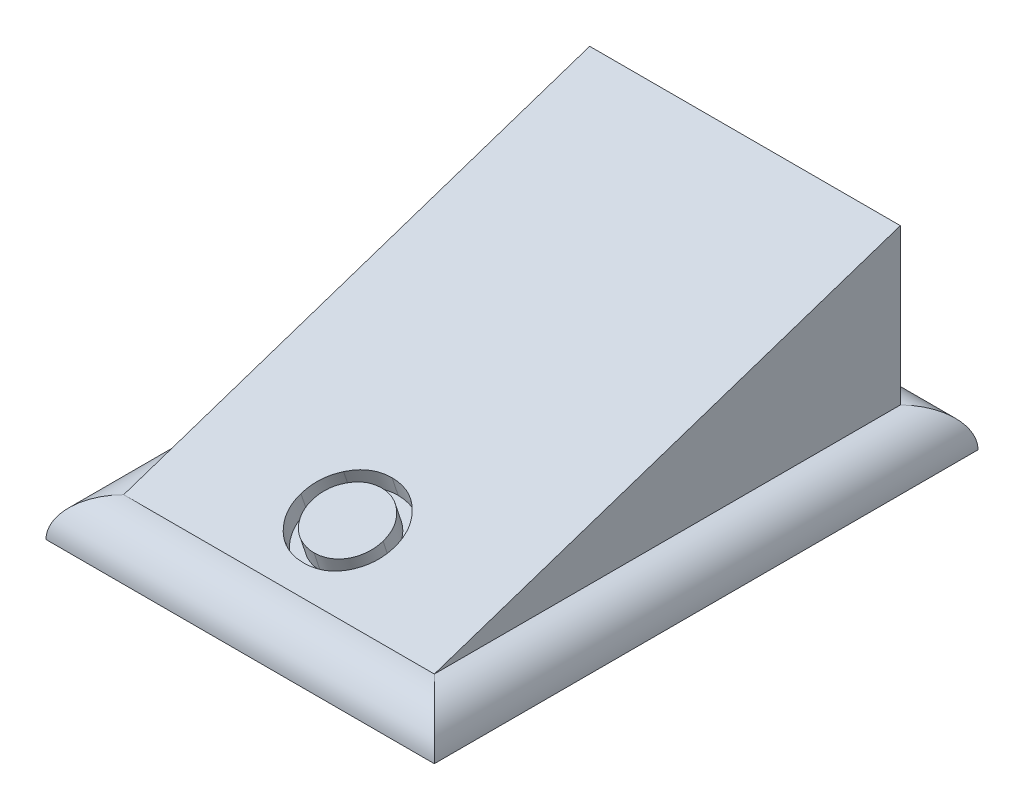
ISO-10303-21;
HEADER;
FILE_DESCRIPTION(('STEP AP214'),'2;1');
FILE_NAME('part.step','',(''),(''),'','','');
FILE_SCHEMA(('AUTOMOTIVE_DESIGN { 1 0 10303 214 1 1 1 1 }'));
ENDSEC;
DATA;
#1=APPLICATION_CONTEXT('core data for automotive mechanical design processes');
#2=APPLICATION_PROTOCOL_DEFINITION('international standard','automotive_design',2000,#1);
#3=PRODUCT_CONTEXT('',#1,'mechanical');
#4=PRODUCT('Part','Part','',(#3));
#5=PRODUCT_RELATED_PRODUCT_CATEGORY('part','',(#4));
#6=PRODUCT_DEFINITION_FORMATION('','',#4);
#7=PRODUCT_DEFINITION_CONTEXT('part definition',#1,'design');
#8=PRODUCT_DEFINITION('design','',#6,#7);
#9=PRODUCT_DEFINITION_SHAPE('','',#8);
#10=(LENGTH_UNIT() NAMED_UNIT(*) SI_UNIT(.MILLI.,.METRE.));
#11=(NAMED_UNIT(*) PLANE_ANGLE_UNIT() SI_UNIT($,.RADIAN.));
#12=(NAMED_UNIT(*) SI_UNIT($,.STERADIAN.) SOLID_ANGLE_UNIT());
#13=UNCERTAINTY_MEASURE_WITH_UNIT(LENGTH_MEASURE(1.E-05),#10,'distance_accuracy_value','');
#14=(GEOMETRIC_REPRESENTATION_CONTEXT(3) GLOBAL_UNCERTAINTY_ASSIGNED_CONTEXT((#13)) GLOBAL_UNIT_ASSIGNED_CONTEXT((#10,
#11,#12)) REPRESENTATION_CONTEXT('',''));
#15=CARTESIAN_POINT('',(0.,0.,0.));
#16=DIRECTION('',(0.,0.,1.));
#17=DIRECTION('',(1.,0.,0.));
#18=AXIS2_PLACEMENT_3D('',#15,#16,#17);
#19=CARTESIAN_POINT('',(9.,5.,-13.));
#20=DIRECTION('',(0.,-0.948683298050514,-0.316227766016838));
#21=DIRECTION('',(0.,0.316227766016838,-0.948683298050514));
#22=AXIS2_PLACEMENT_3D('',#19,#20,#21);
#23=PLANE('',#22);
#24=DIRECTION('',(0.,-0.316227766016838,0.948683298050514));
#25=VECTOR('',#24,1.);
#26=CARTESIAN_POINT('',(0.999999999999996,5.,-13.));
#27=LINE('',#26,#25);
#28=CARTESIAN_POINT('',(0.999999999999996,5.,-13.));
#29=VERTEX_POINT('',#28);
#30=CARTESIAN_POINT('',(1.,1.,-1.));
#31=VERTEX_POINT('',#30);
#32=EDGE_CURVE('E302',#29,#31,#27,.T.);
#33=ORIENTED_EDGE('',*,*,#32,.T.);
#34=DIRECTION('',(1.,0.,0.));
#35=VECTOR('',#34,1.);
#36=CARTESIAN_POINT('',(1.,1.,-1.));
#37=LINE('',#36,#35);
#38=CARTESIAN_POINT('',(9.,1.,-1.));
#39=VERTEX_POINT('',#38);
#40=EDGE_CURVE('E318',#31,#39,#37,.T.);
#41=ORIENTED_EDGE('',*,*,#40,.T.);
#42=DIRECTION('',(0.,-0.316227766016838,0.948683298050514));
#43=VECTOR('',#42,1.);
#44=CARTESIAN_POINT('',(9.,5.,-13.));
#45=LINE('',#44,#43);
#46=CARTESIAN_POINT('',(9.,5.,-13.));
#47=VERTEX_POINT('',#46);
#48=EDGE_CURVE('E303',#47,#39,#45,.T.);
#49=ORIENTED_EDGE('',*,*,#48,.F.);
#50=DIRECTION('',(-1.,0.,0.));
#51=VECTOR('',#50,1.);
#52=CARTESIAN_POINT('',(0.999999999999996,5.,-13.));
#53=LINE('',#52,#51);
#54=EDGE_CURVE('E310',#47,#29,#53,.T.);
#55=ORIENTED_EDGE('',*,*,#54,.T.);
#56=EDGE_LOOP('',(#33,#41,#49,#55));
#57=FACE_BOUND('',#56,.T.);
#58=CARTESIAN_POINT('',(4.15380107665107,1.83676072756491,-3.51028218269474));
#59=CARTESIAN_POINT('',(4.18323658422468,1.84650690635683,-3.5395207190705));
#60=CARTESIAN_POINT('',(4.24112668928849,1.86567448187168,-3.59702344561503));
#61=CARTESIAN_POINT('',(4.3385073208705,1.89021066326277,-3.67063198978829));
#62=CARTESIAN_POINT('',(4.44055528716357,1.91141450607375,-3.73424351822124));
#63=CARTESIAN_POINT('',(4.54916289873117,1.92847607681985,-3.78542823045956));
#64=CARTESIAN_POINT('',(4.66317520559105,1.94191235008891,-3.82573705026673));
#65=CARTESIAN_POINT('',(4.78311694702706,1.95125421617415,-3.85376264852244));
#66=CARTESIAN_POINT('',(4.90855259319389,1.95735103347558,-3.87205310042674));
#67=CARTESIAN_POINT('',(4.99433167804488,1.95794145009789,-3.87382435029368));
#68=CARTESIAN_POINT('',(5.0378655798562,1.95824109352855,-3.87472328058566));
#69=B_SPLINE_CURVE_WITH_KNOTS('',3,(#58,#59,#60,#61,#62,#63,#64,#65,#66,#67,#68),.UNSPECIFIED.,
.F.,.F.,(4,1,1,1,1,1,1,1,4),(0.,0.128497521137512,0.252712985515453,0.374819132567046,
0.49643642637273,0.617910556745852,0.74128761730929,0.868700400744608,1.),.UNSPECIFIED.);
#70=CARTESIAN_POINT('',(4.15380107665107,1.83676072756491,-3.51028218269474));
#71=VERTEX_POINT('',#70);
#72=CARTESIAN_POINT('',(5.0378655798562,1.95824109352855,-3.87472328058566));
#73=VERTEX_POINT('',#72);
#74=EDGE_CURVE('E63',#71,#73,#69,.T.);
#75=ORIENTED_EDGE('',*,*,#74,.T.);
#76=CARTESIAN_POINT('',(5.0378655798562,1.95824109352855,-3.87472328058566));
#77=CARTESIAN_POINT('',(5.08140052022116,1.957947949995,-3.873843849985));
#78=CARTESIAN_POINT('',(5.16676189887369,1.95737316716637,-3.87211950149912));
#79=CARTESIAN_POINT('',(5.29177333820709,1.95122998961671,-3.85368996885014));
#80=CARTESIAN_POINT('',(5.4111035686636,1.94183595756607,-3.8255078726982));
#81=CARTESIAN_POINT('',(5.52520961441194,1.92884918708578,-3.78654756125734));
#82=CARTESIAN_POINT('',(5.63263011100122,1.91144173463805,-3.73432520391415));
#83=CARTESIAN_POINT('',(5.73492973958487,1.8906701331868,-3.6720103995604));
#84=CARTESIAN_POINT('',(5.83182802621619,1.86606221592538,-3.59818664777614));
#85=CARTESIAN_POINT('',(5.88990605989951,1.84702649097998,-3.54107947293995));
#86=CARTESIAN_POINT('',(5.91938601254851,1.83736410686606,-3.51209232059817));
#87=B_SPLINE_CURVE_WITH_KNOTS('',3,(#76,#77,#78,#79,#80,#81,#82,#83,#84,#85,#86),.UNSPECIFIED.,
.F.,.F.,(4,1,1,1,1,1,1,1,4),(0.,0.131751427302405,0.258332350514159,0.382133976092545,
0.503804391600085,0.624692986540933,0.746870589727577,0.871513504234816,1.),.UNSPECIFIED.);
#88=CARTESIAN_POINT('',(5.91938601254851,1.83736410686606,-3.51209232059817));
#89=VERTEX_POINT('',#88);
#90=EDGE_CURVE('E236',#73,#89,#87,.T.);
#91=ORIENTED_EDGE('',*,*,#90,.T.);
#92=CARTESIAN_POINT('',(5.91938601254851,1.83736410686606,-3.51209232059817));
#93=CARTESIAN_POINT('',(5.94476964230743,1.82812308180457,-3.48436924541372));
#94=CARTESIAN_POINT('',(5.99504565866621,1.80981987097241,-3.42945961291723));
#95=CARTESIAN_POINT('',(6.0595124178537,1.78014220493054,-3.3404266147916));
#96=CARTESIAN_POINT('',(6.11504911885366,1.7494075929167,-3.2482227787501));
#97=CARTESIAN_POINT('',(6.15955623346302,1.71720790283073,-3.15162370849218));
#98=CARTESIAN_POINT('',(6.19464907637746,1.68382422719116,-3.05147268157348));
#99=CARTESIAN_POINT('',(6.21956438655191,1.64914182177865,-2.94742546533593));
#100=CARTESIAN_POINT('',(6.23438432039072,1.61323728036446,-2.83971184109338));
#101=CARTESIAN_POINT('',(6.23638272611635,1.5888527598296,-2.7665582794888));
#102=CARTESIAN_POINT('',(6.23739482665107,1.57650312233818,-2.72950936701452));
#103=B_SPLINE_CURVE_WITH_KNOTS('',3,(#92,#93,#94,#95,#96,#97,#98,#99,#100,#101,#102),
.UNSPECIFIED.,.F.,.F.,(4,1,1,1,1,1,1,1,4),(0.,0.128157279593186,0.253834362796735,
0.376505622522209,0.49853368566791,0.621367728732463,0.744564744904358,0.870633798255283,1.),.UNSPECIFIED.);
#104=CARTESIAN_POINT('',(6.23739482665107,1.57650312233818,-2.72950936701452));
#105=VERTEX_POINT('',#104);
#106=EDGE_CURVE('E245',#89,#105,#103,.T.);
#107=ORIENTED_EDGE('',*,*,#106,.T.);
#108=CARTESIAN_POINT('',(6.23739482665107,1.57650312233818,-2.72950936701452));
#109=CARTESIAN_POINT('',(6.23650461351269,1.56408190502037,-2.6922457150611));
#110=CARTESIAN_POINT('',(6.23474551083507,1.53953700032176,-2.61861100096527));
#111=CARTESIAN_POINT('',(6.21810523025175,1.50338661132315,-2.51015983396945));
#112=CARTESIAN_POINT('',(6.19222345949166,1.46833334513621,-2.40500003540864));
#113=CARTESIAN_POINT('',(6.15518314914353,1.4345239571952,-2.3035718715856));
#114=CARTESIAN_POINT('',(6.1076868643116,1.40185510121879,-2.20556530365637));
#115=CARTESIAN_POINT('',(6.04972888347757,1.37046946662041,-2.11140839986123));
#116=CARTESIAN_POINT('',(5.98090248791852,1.34030513038469,-2.02091539115406));
#117=CARTESIAN_POINT('',(5.9028845765734,1.31161822713945,-1.93485468141834));
#118=CARTESIAN_POINT('',(5.81665894606464,1.2851790802951,-1.85553724088531));
#119=CARTESIAN_POINT('',(5.72311786866091,1.26213581092322,-1.78640743276967));
#120=CARTESIAN_POINT('',(5.62409956661544,1.24239340973092,-1.72718022919277));
#121=CARTESIAN_POINT('',(5.51828738185912,1.22649071115263,-1.67947213345789));
#122=CARTESIAN_POINT('',(5.40664759023317,1.21395198220896,-1.64185594662689));
#123=CARTESIAN_POINT('',(5.28893939273787,1.20514526008908,-1.61543578026725));
#124=CARTESIAN_POINT('',(5.16534565038229,1.19982058570442,-1.59946175711327));
#125=CARTESIAN_POINT('',(5.08095667100011,1.19913682491854,-1.59741047475561));
#126=CARTESIAN_POINT('',(5.0378655798562,1.19878767982209,-1.59636303946627));
#127=B_SPLINE_CURVE_WITH_KNOTS('',3,(#108,#109,#110,#111,#112,#113,#114,#115,#116,#117,#118,
#119,#120,#121,#122,#123,#124,#125,#126),.UNSPECIFIED.,.F.,.F.,(4,1,1,1,1,1,1,1,1,1,1,1,1,1,1,1,
4),(0.,0.0624160261588176,0.12333697853733,0.183265139853092,0.243172443069709,
0.302898353919745,0.36377359750391,0.425605304952382,0.489659042510184,0.553784576792116,
0.616221532811073,0.677854471308342,0.739516897487938,0.802096535576372,0.865865841277971,
0.931507795196511,1.),.UNSPECIFIED.);
#128=CARTESIAN_POINT('',(5.0378655798562,1.19878767982209,-1.59636303946627));
#129=VERTEX_POINT('',#128);
#130=EDGE_CURVE('E254',#105,#129,#127,.T.);
#131=ORIENTED_EDGE('',*,*,#130,.T.);
#132=CARTESIAN_POINT('',(5.0378655798562,1.19878767982209,-1.59636303946627));
#133=CARTESIAN_POINT('',(4.99456337001594,1.19913799675978,-1.59741399027935));
#134=CARTESIAN_POINT('',(4.9097538044093,1.19982411018033,-1.59947233054097));
#135=CARTESIAN_POINT('',(4.78572380652178,1.20512457296342,-1.61537371889026));
#136=CARTESIAN_POINT('',(4.66780465220229,1.21394792346786,-1.64184377040357));
#137=CARTESIAN_POINT('',(4.55601870925969,1.22653191733786,-1.67959575201356));
#138=CARTESIAN_POINT('',(4.44975159809327,1.24239391801954,-1.72718175405862));
#139=CARTESIAN_POINT('',(4.35015956157491,1.2620761252151,-1.78622837564531));
#140=CARTESIAN_POINT('',(4.25654249535695,1.28518591418632,-1.85555774255895));
#141=CARTESIAN_POINT('',(4.17029862377967,1.31161637544331,-1.93484912632993));
#142=CARTESIAN_POINT('',(4.09228560323387,1.34030560747015,-2.02091682241044));
#143=CARTESIAN_POINT('',(4.02345794565812,1.37046934278952,-2.11140802836857));
#144=CARTESIAN_POINT('',(3.96550029265058,1.40185513348433,-2.20556540045299));
#145=CARTESIAN_POINT('',(3.91800392198609,1.43452394859109,-2.30357184577325));
#146=CARTESIAN_POINT('',(3.88096363455323,1.46833334744334,-2.40500004233001));
#147=CARTESIAN_POINT('',(3.85508185763268,1.50338661069693,-2.5101598320908));
#148=CARTESIAN_POINT('',(3.83844157870503,1.5395370004839,-2.6186110014517));
#149=CARTESIAN_POINT('',(3.83668247580131,1.56408190507485,-2.69224571522455));
#150=CARTESIAN_POINT('',(3.83579226254851,1.57650312233818,-2.72950936701452));
#151=B_SPLINE_CURVE_WITH_KNOTS('',3,(#132,#133,#134,#135,#136,#137,#138,#139,#140,#141,#142,
#143,#144,#145,#146,#147,#148,#149,#150),.UNSPECIFIED.,.F.,.F.,(4,1,1,1,1,1,1,1,1,1,1,1,1,1,1,1,
4),(0.,0.0687422616054886,0.134635192224277,0.198324187067147,0.260825012560421,
0.322713588159025,0.384554534607619,0.446912857724756,0.510957632514829,0.574930701001336,
0.636684537796093,0.697483115294062,0.757133807523855,0.816965663675264,0.876818351657196,
0.937662580384003,1.),.UNSPECIFIED.);
#152=CARTESIAN_POINT('',(3.83579226254851,1.57650312233818,-2.72950936701452));
#153=VERTEX_POINT('',#152);
#154=EDGE_CURVE('E263',#129,#153,#151,.T.);
#155=ORIENTED_EDGE('',*,*,#154,.T.);
#156=CARTESIAN_POINT('',(3.83579226254851,1.57650312233818,-2.72950936701452));
#157=CARTESIAN_POINT('',(3.83681126551217,1.5887856376478,-2.76635691294338));
#158=CARTESIAN_POINT('',(3.8388287162542,1.61310290708578,-2.83930872125734));
#159=CARTESIAN_POINT('',(3.8536337494859,1.64893995332653,-2.94681985997958));
#160=CARTESIAN_POINT('',(3.87845186858253,1.68356366007589,-3.05069098022767));
#161=CARTESIAN_POINT('',(3.91358677822346,1.71681847790042,-3.15045543370127));
#162=CARTESIAN_POINT('',(3.95850412996064,1.74887706239072,-3.24663118717215));
#163=CARTESIAN_POINT('',(4.01326044116715,1.77968761596073,-3.33906284788219));
#164=CARTESIAN_POINT('',(4.07838480068604,1.80923108355497,-3.42769325066491));
#165=CARTESIAN_POINT('',(4.12846085671894,1.82751063897411,-3.48253191692232));
#166=CARTESIAN_POINT('',(4.15380107665107,1.83676072756491,-3.51028218269474));
#167=B_SPLINE_CURVE_WITH_KNOTS('',3,(#156,#157,#158,#159,#160,#161,#162,#163,#164,#165,#166),
.UNSPECIFIED.,.F.,.F.,(4,1,1,1,1,1,1,1,4),(0.,0.128919131811961,0.255237724924907,
0.378678595978551,0.501087887185133,0.622713679429778,0.746240794938382,0.87158904723167,1.),.UNSPECIFIED.);
#168=EDGE_CURVE('E272',#153,#71,#167,.T.);
#169=ORIENTED_EDGE('',*,*,#168,.T.);
#170=EDGE_LOOP('',(#75,#91,#107,#131,#155,#169));
#171=FACE_BOUND('',#170,.T.);
#172=ADVANCED_FACE('F45',(#57,#171),#23,.F.);
#173=CARTESIAN_POINT('',(0.,0.,0.));
#174=DIRECTION('',(0.,-1.,0.));
#175=DIRECTION('',(0.,0.,-1.));
#176=AXIS2_PLACEMENT_3D('',#173,#174,#175);
#177=PLANE('',#176);
#178=DIRECTION('',(0.,0.,1.));
#179=VECTOR('',#178,1.);
#180=CARTESIAN_POINT('',(0.,0.,0.));
#181=LINE('',#180,#179);
#182=CARTESIAN_POINT('',(0.,0.,-14.));
#183=VERTEX_POINT('',#182);
#184=CARTESIAN_POINT('',(0.,0.,0.));
#185=VERTEX_POINT('',#184);
#186=EDGE_CURVE('E334',#183,#185,#181,.T.);
#187=ORIENTED_EDGE('',*,*,#186,.F.);
#188=DIRECTION('',(-1.,0.,0.));
#189=VECTOR('',#188,1.);
#190=CARTESIAN_POINT('',(0.,0.,-14.));
#191=LINE('',#190,#189);
#192=CARTESIAN_POINT('',(10.,0.,-14.));
#193=VERTEX_POINT('',#192);
#194=EDGE_CURVE('E11',#193,#183,#191,.T.);
#195=ORIENTED_EDGE('',*,*,#194,.F.);
#196=DIRECTION('',(0.,0.,-1.));
#197=VECTOR('',#196,1.);
#198=CARTESIAN_POINT('',(10.,0.,0.));
#199=LINE('',#198,#197);
#200=CARTESIAN_POINT('',(10.,0.,0.));
#201=VERTEX_POINT('',#200);
#202=EDGE_CURVE('E55',#201,#193,#199,.T.);
#203=ORIENTED_EDGE('',*,*,#202,.F.);
#204=DIRECTION('',(1.,0.,0.));
#205=VECTOR('',#204,1.);
#206=CARTESIAN_POINT('',(0.,0.,0.));
#207=LINE('',#206,#205);
#208=EDGE_CURVE('E338',#185,#201,#207,.T.);
#209=ORIENTED_EDGE('',*,*,#208,.F.);
#210=EDGE_LOOP('',(#187,#195,#203,#209));
#211=FACE_BOUND('',#210,.T.);
#212=ADVANCED_FACE('F425',(#211),#177,.T.);
#213=CARTESIAN_POINT('',(0.999999999999996,5.,-13.));
#214=DIRECTION('',(1.,0.,0.));
#215=DIRECTION('',(0.,0.,-1.));
#216=AXIS2_PLACEMENT_3D('',#213,#214,#215);
#217=PLANE('',#216);
#218=DIRECTION('',(0.,0.,1.));
#219=VECTOR('',#218,1.);
#220=CARTESIAN_POINT('',(0.999999999999996,1.,-13.));
#221=LINE('',#220,#219);
#222=CARTESIAN_POINT('',(0.999999999999996,1.,-13.));
#223=VERTEX_POINT('',#222);
#224=EDGE_CURVE('E307',#223,#31,#221,.T.);
#225=ORIENTED_EDGE('',*,*,#224,.T.);
#226=ORIENTED_EDGE('',*,*,#32,.F.);
#227=DIRECTION('',(0.,-1.,0.));
#228=VECTOR('',#227,1.);
#229=CARTESIAN_POINT('',(0.999999999999996,5.,-13.));
#230=LINE('',#229,#228);
#231=EDGE_CURVE('E313',#29,#223,#230,.T.);
#232=ORIENTED_EDGE('',*,*,#231,.T.);
#233=EDGE_LOOP('',(#225,#226,#232));
#234=FACE_BOUND('',#233,.T.);
#235=ADVANCED_FACE('F434',(#234),#217,.F.);
#236=CARTESIAN_POINT('',(9.,5.,-13.));
#237=DIRECTION('',(-1.,0.,0.));
#238=DIRECTION('',(0.,0.,1.));
#239=AXIS2_PLACEMENT_3D('',#236,#237,#238);
#240=PLANE('',#239);
#241=DIRECTION('',(0.,-1.,0.));
#242=VECTOR('',#241,1.);
#243=CARTESIAN_POINT('',(9.,5.,-13.));
#244=LINE('',#243,#242);
#245=CARTESIAN_POINT('',(9.,1.,-13.));
#246=VERTEX_POINT('',#245);
#247=EDGE_CURVE('E330',#47,#246,#244,.T.);
#248=ORIENTED_EDGE('',*,*,#247,.F.);
#249=ORIENTED_EDGE('',*,*,#48,.T.);
#250=DIRECTION('',(0.,0.,-1.));
#251=VECTOR('',#250,1.);
#252=CARTESIAN_POINT('',(9.,1.,-13.));
#253=LINE('',#252,#251);
#254=EDGE_CURVE('E321',#39,#246,#253,.T.);
#255=ORIENTED_EDGE('',*,*,#254,.T.);
#256=EDGE_LOOP('',(#248,#249,#255));
#257=FACE_BOUND('',#256,.T.);
#258=ADVANCED_FACE('F430',(#257),#240,.F.);
#259=CARTESIAN_POINT('',(0.999999999999996,5.,-13.));
#260=DIRECTION('',(0.,0.,1.));
#261=DIRECTION('',(1.,0.,0.));
#262=AXIS2_PLACEMENT_3D('',#259,#260,#261);
#263=PLANE('',#262);
#264=DIRECTION('',(-1.,0.,0.));
#265=VECTOR('',#264,1.);
#266=CARTESIAN_POINT('',(0.999999999999996,1.,-13.));
#267=LINE('',#266,#265);
#268=EDGE_CURVE('E314',#246,#223,#267,.T.);
#269=ORIENTED_EDGE('',*,*,#268,.T.);
#270=ORIENTED_EDGE('',*,*,#231,.F.);
#271=ORIENTED_EDGE('',*,*,#54,.F.);
#272=ORIENTED_EDGE('',*,*,#247,.T.);
#273=EDGE_LOOP('',(#269,#270,#271,#272));
#274=FACE_BOUND('',#273,.T.);
#275=ADVANCED_FACE('F421',(#274),#263,.F.);
#276=CARTESIAN_POINT('',(4.15380107665107,1.36241907853966,-3.66839606570316));
#277=CARTESIAN_POINT('',(4.18323658422468,1.37216525733158,-3.69763460207892));
#278=CARTESIAN_POINT('',(4.24112668928849,1.39133283284642,-3.75513732862345));
#279=CARTESIAN_POINT('',(4.3385073208705,1.41586901423751,-3.82874587279671));
#280=CARTESIAN_POINT('',(4.44055528716357,1.43707285704849,-3.89235740122966));
#281=CARTESIAN_POINT('',(4.54916289873117,1.4541344277946,-3.94354211346797));
#282=CARTESIAN_POINT('',(4.66317520559105,1.46757070106366,-3.98385093327515));
#283=CARTESIAN_POINT('',(4.78311694702706,1.47691256714889,-4.01187653153086));
#284=CARTESIAN_POINT('',(4.90855259319389,1.48300938445032,-4.03016698343516));
#285=CARTESIAN_POINT('',(4.99433167804488,1.48359980107264,-4.0319382333021));
#286=CARTESIAN_POINT('',(5.0378655798562,1.4838994445033,-4.03283716359408));
#287=B_SPLINE_CURVE_WITH_KNOTS('',3,(#276,#277,#278,#279,#280,#281,#282,#283,#284,#285,#286),
.UNSPECIFIED.,.F.,.F.,(4,1,1,1,1,1,1,1,4),(0.,0.128497521137512,0.252712985515453,
0.374819132567046,0.49643642637273,0.617910556745852,0.74128761730929,0.868700400744608,1.),.UNSPECIFIED.);
#288=DIRECTION('',(0.,0.948683298050514,0.316227766016838));
#289=VECTOR('',#288,1.);
#290=SURFACE_OF_LINEAR_EXTRUSION('',#287,#289);
#291=ORIENTED_EDGE('',*,*,#74,.F.);
#292=DIRECTION('',(0.,0.948683298050514,0.316227766016838));
#293=VECTOR('',#292,1.);
#294=CARTESIAN_POINT('',(4.15380107665107,1.36241907853966,-3.66839606570316));
#295=LINE('',#294,#293);
#296=CARTESIAN_POINT('',(4.15380107665107,1.36241907853966,-3.66839606570316));
#297=VERTEX_POINT('',#296);
#298=EDGE_CURVE('E223',#297,#71,#295,.T.);
#299=ORIENTED_EDGE('',*,*,#298,.F.);
#300=CARTESIAN_POINT('',(5.0378655798562,1.4838994445033,-4.03283716359408));
#301=VERTEX_POINT('',#300);
#302=EDGE_CURVE('E281',#297,#301,#287,.T.);
#303=ORIENTED_EDGE('',*,*,#302,.T.);
#304=DIRECTION('',(0.,0.948683298050514,0.316227766016838));
#305=VECTOR('',#304,1.);
#306=CARTESIAN_POINT('',(5.0378655798562,1.4838994445033,-4.03283716359408));
#307=LINE('',#306,#305);
#308=EDGE_CURVE('E299',#301,#73,#307,.T.);
#309=ORIENTED_EDGE('',*,*,#308,.T.);
#310=EDGE_LOOP('',(#291,#299,#303,#309));
#311=FACE_BOUND('',#310,.T.);
#312=ADVANCED_FACE('F416',(#311),#290,.T.);
#313=CARTESIAN_POINT('',(5.0378655798562,1.4838994445033,-4.03283716359408));
#314=CARTESIAN_POINT('',(5.08140052022116,1.48360630096974,-4.03195773299342));
#315=CARTESIAN_POINT('',(5.16676189887369,1.48303151814112,-4.03023338450753));
#316=CARTESIAN_POINT('',(5.29177333820709,1.47688834059146,-4.01180385185856));
#317=CARTESIAN_POINT('',(5.4111035686636,1.46749430854081,-3.98362175570662));
#318=CARTESIAN_POINT('',(5.52520961441194,1.45450753806052,-3.94466144426576));
#319=CARTESIAN_POINT('',(5.63263011100122,1.4371000856128,-3.89243908692257));
#320=CARTESIAN_POINT('',(5.73492973958487,1.41632848416154,-3.83012428256882));
#321=CARTESIAN_POINT('',(5.83182802621619,1.39172056690012,-3.75630053078456));
#322=CARTESIAN_POINT('',(5.88990605989951,1.37268484195473,-3.69919335594837));
#323=CARTESIAN_POINT('',(5.91938601254851,1.3630224578408,-3.67020620360659));
#324=B_SPLINE_CURVE_WITH_KNOTS('',3,(#313,#314,#315,#316,#317,#318,#319,#320,#321,#322,#323),
.UNSPECIFIED.,.F.,.F.,(4,1,1,1,1,1,1,1,4),(0.,0.131751427302405,0.258332350514159,
0.382133976092545,0.503804391600085,0.624692986540933,0.746870589727577,0.871513504234816,1.),.UNSPECIFIED.);
#325=DIRECTION('',(0.,0.948683298050514,0.316227766016838));
#326=VECTOR('',#325,1.);
#327=SURFACE_OF_LINEAR_EXTRUSION('',#324,#326);
#328=ORIENTED_EDGE('',*,*,#90,.F.);
#329=ORIENTED_EDGE('',*,*,#308,.F.);
#330=CARTESIAN_POINT('',(5.91938601254851,1.3630224578408,-3.67020620360659));
#331=VERTEX_POINT('',#330);
#332=EDGE_CURVE('E407',#301,#331,#324,.T.);
#333=ORIENTED_EDGE('',*,*,#332,.T.);
#334=DIRECTION('',(0.,0.948683298050514,0.316227766016838));
#335=VECTOR('',#334,1.);
#336=CARTESIAN_POINT('',(5.91938601254851,1.3630224578408,-3.67020620360659));
#337=LINE('',#336,#335);
#338=EDGE_CURVE('E296',#331,#89,#337,.T.);
#339=ORIENTED_EDGE('',*,*,#338,.T.);
#340=EDGE_LOOP('',(#328,#329,#333,#339));
#341=FACE_BOUND('',#340,.T.);
#342=ADVANCED_FACE('F420',(#341),#327,.T.);
#343=CARTESIAN_POINT('',(5.91938601254851,1.3630224578408,-3.67020620360659));
#344=CARTESIAN_POINT('',(5.94476964230743,1.35378143277932,-3.64248312842214));
#345=CARTESIAN_POINT('',(5.99504565866621,1.33547822194715,-3.58757349592565));
#346=CARTESIAN_POINT('',(6.0595124178537,1.30580055590528,-3.49854049780002));
#347=CARTESIAN_POINT('',(6.11504911885366,1.27506594389144,-3.40633666175852));
#348=CARTESIAN_POINT('',(6.15955623346302,1.24286625380547,-3.3097375915006));
#349=CARTESIAN_POINT('',(6.19464907637746,1.2094825781659,-3.2095865645819));
#350=CARTESIAN_POINT('',(6.21956438655191,1.17480017275339,-3.10553934834435));
#351=CARTESIAN_POINT('',(6.23438432039072,1.1388956313392,-2.9978257241018));
#352=CARTESIAN_POINT('',(6.23638272611635,1.11451111080434,-2.92467216249722));
#353=CARTESIAN_POINT('',(6.23739482665107,1.10216147331292,-2.88762325002294));
#354=B_SPLINE_CURVE_WITH_KNOTS('',3,(#343,#344,#345,#346,#347,#348,#349,#350,#351,#352,#353),
.UNSPECIFIED.,.F.,.F.,(4,1,1,1,1,1,1,1,4),(0.,0.128157279593186,0.253834362796735,
0.376505622522209,0.49853368566791,0.621367728732463,0.744564744904358,0.870633798255283,1.),.UNSPECIFIED.);
#355=DIRECTION('',(0.,0.948683298050514,0.316227766016838));
#356=VECTOR('',#355,1.);
#357=SURFACE_OF_LINEAR_EXTRUSION('',#354,#356);
#358=ORIENTED_EDGE('',*,*,#106,.F.);
#359=ORIENTED_EDGE('',*,*,#338,.F.);
#360=CARTESIAN_POINT('',(6.23739482665107,1.10216147331292,-2.88762325002294));
#361=VERTEX_POINT('',#360);
#362=EDGE_CURVE('E476',#331,#361,#354,.T.);
#363=ORIENTED_EDGE('',*,*,#362,.T.);
#364=DIRECTION('',(0.,0.948683298050514,0.316227766016838));
#365=VECTOR('',#364,1.);
#366=CARTESIAN_POINT('',(6.23739482665107,1.10216147331292,-2.88762325002294));
#367=LINE('',#366,#365);
#368=EDGE_CURVE('E293',#361,#105,#367,.T.);
#369=ORIENTED_EDGE('',*,*,#368,.T.);
#370=EDGE_LOOP('',(#358,#359,#363,#369));
#371=FACE_BOUND('',#370,.T.);
#372=ADVANCED_FACE('F494',(#371),#357,.T.);
#373=CARTESIAN_POINT('',(6.23739482665107,1.10216147331292,-2.88762325002294));
#374=CARTESIAN_POINT('',(6.23650461351269,1.08974025599511,-2.85035959806952));
#375=CARTESIAN_POINT('',(6.23474551083507,1.0651953512965,-2.77672488397369));
#376=CARTESIAN_POINT('',(6.21810523025175,1.02904496229789,-2.66827371697787));
#377=CARTESIAN_POINT('',(6.19222345949166,0.993991696110958,-2.56311391841706));
#378=CARTESIAN_POINT('',(6.15518314914353,0.960182308169943,-2.46168575459402));
#379=CARTESIAN_POINT('',(6.1076868643116,0.927513452193532,-2.36367918666478));
#380=CARTESIAN_POINT('',(6.04972888347757,0.896127817595154,-2.26952228286965));
#381=CARTESIAN_POINT('',(5.98090248791852,0.86596348135943,-2.17902927416248));
#382=CARTESIAN_POINT('',(5.9028845765734,0.837276578114192,-2.09296856442676));
#383=CARTESIAN_POINT('',(5.81665894606464,0.810837431269847,-2.01365112389373));
#384=CARTESIAN_POINT('',(5.72311786866091,0.787794161897966,-1.94452131577809));
#385=CARTESIAN_POINT('',(5.62409956661544,0.768051760705667,-1.88529411220119));
#386=CARTESIAN_POINT('',(5.51828738185912,0.752149062127373,-1.83758601646631));
#387=CARTESIAN_POINT('',(5.40664759023317,0.739610333183705,-1.7999698296353));
#388=CARTESIAN_POINT('',(5.28893939273787,0.730803611063828,-1.77354966327567));
#389=CARTESIAN_POINT('',(5.16534565038229,0.725478936679168,-1.75757564012169));
#390=CARTESIAN_POINT('',(5.08095667100011,0.724795175893279,-1.75552435776402));
#391=CARTESIAN_POINT('',(5.0378655798562,0.724446030796833,-1.75447692247469));
#392=B_SPLINE_CURVE_WITH_KNOTS('',3,(#373,#374,#375,#376,#377,#378,#379,#380,#381,#382,#383,
#384,#385,#386,#387,#388,#389,#390,#391),.UNSPECIFIED.,.F.,.F.,(4,1,1,1,1,1,1,1,1,1,1,1,1,1,1,1,
4),(0.,0.0624160261588176,0.12333697853733,0.183265139853092,0.243172443069709,
0.302898353919745,0.36377359750391,0.425605304952382,0.489659042510184,0.553784576792116,
0.616221532811073,0.677854471308342,0.739516897487938,0.802096535576372,0.865865841277971,
0.931507795196511,1.),.UNSPECIFIED.);
#393=DIRECTION('',(0.,0.948683298050514,0.316227766016838));
#394=VECTOR('',#393,1.);
#395=SURFACE_OF_LINEAR_EXTRUSION('',#392,#394);
#396=ORIENTED_EDGE('',*,*,#130,.F.);
#397=ORIENTED_EDGE('',*,*,#368,.F.);
#398=CARTESIAN_POINT('',(5.0378655798562,0.724446030796833,-1.75447692247469));
#399=VERTEX_POINT('',#398);
#400=EDGE_CURVE('E481',#361,#399,#392,.T.);
#401=ORIENTED_EDGE('',*,*,#400,.T.);
#402=DIRECTION('',(0.,0.948683298050514,0.316227766016838));
#403=VECTOR('',#402,1.);
#404=CARTESIAN_POINT('',(5.0378655798562,0.724446030796833,-1.75447692247469));
#405=LINE('',#404,#403);
#406=EDGE_CURVE('E290',#399,#129,#405,.T.);
#407=ORIENTED_EDGE('',*,*,#406,.T.);
#408=EDGE_LOOP('',(#396,#397,#401,#407));
#409=FACE_BOUND('',#408,.T.);
#410=ADVANCED_FACE('F496',(#409),#395,.T.);
#411=CARTESIAN_POINT('',(5.0378655798562,0.724446030796833,-1.75447692247469));
#412=CARTESIAN_POINT('',(4.99456337001594,0.724796347734527,-1.75552787328777));
#413=CARTESIAN_POINT('',(4.9097538044093,0.725482461155068,-1.75758621354939));
#414=CARTESIAN_POINT('',(4.78572380652178,0.730782923938164,-1.77348760189868));
#415=CARTESIAN_POINT('',(4.66780465220229,0.739606274442602,-1.79995765341199));
#416=CARTESIAN_POINT('',(4.55601870925969,0.752190268312598,-1.83770963502198));
#417=CARTESIAN_POINT('',(4.44975159809327,0.768052268994284,-1.88529563706704));
#418=CARTESIAN_POINT('',(4.35015956157491,0.787734476189847,-1.94434225865373));
#419=CARTESIAN_POINT('',(4.25654249535695,0.81084426516106,-2.01367162556737));
#420=CARTESIAN_POINT('',(4.17029862377967,0.837274726418054,-2.09296300933835));
#421=CARTESIAN_POINT('',(4.09228560323387,0.86596395844489,-2.17903070541886));
#422=CARTESIAN_POINT('',(4.02345794565812,0.896127693764268,-2.26952191137699));
#423=CARTESIAN_POINT('',(3.96550029265058,0.927513484459074,-2.36367928346141));
#424=CARTESIAN_POINT('',(3.91800392198609,0.960182299565829,-2.46168572878167));
#425=CARTESIAN_POINT('',(3.88096363455323,0.993991698418081,-2.56311392533843));
#426=CARTESIAN_POINT('',(3.85508185763268,1.02904496167168,-2.66827371509922));
#427=CARTESIAN_POINT('',(3.83844157870503,1.06519535145864,-2.77672488446012));
#428=CARTESIAN_POINT('',(3.83668247580131,1.08974025604959,-2.85035959823296));
#429=CARTESIAN_POINT('',(3.83579226254851,1.10216147331292,-2.88762325002294));
#430=B_SPLINE_CURVE_WITH_KNOTS('',3,(#411,#412,#413,#414,#415,#416,#417,#418,#419,#420,#421,
#422,#423,#424,#425,#426,#427,#428,#429),.UNSPECIFIED.,.F.,.F.,(4,1,1,1,1,1,1,1,1,1,1,1,1,1,1,1,
4),(0.,0.0687422616054886,0.134635192224277,0.198324187067147,0.260825012560421,
0.322713588159025,0.384554534607619,0.446912857724756,0.510957632514829,0.574930701001336,
0.636684537796093,0.697483115294062,0.757133807523855,0.816965663675264,0.876818351657196,
0.937662580384003,1.),.UNSPECIFIED.);
#431=DIRECTION('',(0.,0.948683298050514,0.316227766016838));
#432=VECTOR('',#431,1.);
#433=SURFACE_OF_LINEAR_EXTRUSION('',#430,#432);
#434=ORIENTED_EDGE('',*,*,#154,.F.);
#435=ORIENTED_EDGE('',*,*,#406,.F.);
#436=CARTESIAN_POINT('',(3.83579226254851,1.10216147331292,-2.88762325002294));
#437=VERTEX_POINT('',#436);
#438=EDGE_CURVE('E224',#399,#437,#430,.T.);
#439=ORIENTED_EDGE('',*,*,#438,.T.);
#440=DIRECTION('',(0.,0.948683298050514,0.316227766016838));
#441=VECTOR('',#440,1.);
#442=CARTESIAN_POINT('',(3.83579226254851,1.10216147331292,-2.88762325002294));
#443=LINE('',#442,#441);
#444=EDGE_CURVE('E287',#437,#153,#443,.T.);
#445=ORIENTED_EDGE('',*,*,#444,.T.);
#446=EDGE_LOOP('',(#434,#435,#439,#445));
#447=FACE_BOUND('',#446,.T.);
#448=ADVANCED_FACE('F213',(#447),#433,.T.);
#449=CARTESIAN_POINT('',(3.83579226254851,1.10216147331292,-2.88762325002294));
#450=CARTESIAN_POINT('',(3.83681126551217,1.11444398862254,-2.9244707959518));
#451=CARTESIAN_POINT('',(3.8388287162542,1.13876125806053,-2.99742260426576));
#452=CARTESIAN_POINT('',(3.8536337494859,1.17459830430127,-3.104933742988));
#453=CARTESIAN_POINT('',(3.87845186858253,1.20922201105063,-3.20880486323609));
#454=CARTESIAN_POINT('',(3.91358677822346,1.24247682887517,-3.30856931670969));
#455=CARTESIAN_POINT('',(3.95850412996064,1.27453541336546,-3.40474507018057));
#456=CARTESIAN_POINT('',(4.01326044116715,1.30534596693548,-3.49717673089061));
#457=CARTESIAN_POINT('',(4.07838480068604,1.33488943452971,-3.58580713367333));
#458=CARTESIAN_POINT('',(4.12846085671894,1.35316898994885,-3.64064579993074));
#459=CARTESIAN_POINT('',(4.15380107665107,1.36241907853966,-3.66839606570316));
#460=B_SPLINE_CURVE_WITH_KNOTS('',3,(#449,#450,#451,#452,#453,#454,#455,#456,#457,#458,#459),
.UNSPECIFIED.,.F.,.F.,(4,1,1,1,1,1,1,1,4),(0.,0.128919131811961,0.255237724924907,
0.378678595978551,0.501087887185133,0.622713679429778,0.746240794938382,0.87158904723167,1.),.UNSPECIFIED.);
#461=DIRECTION('',(0.,0.948683298050514,0.316227766016838));
#462=VECTOR('',#461,1.);
#463=SURFACE_OF_LINEAR_EXTRUSION('',#460,#462);
#464=ORIENTED_EDGE('',*,*,#168,.F.);
#465=ORIENTED_EDGE('',*,*,#444,.F.);
#466=EDGE_CURVE('E217',#437,#297,#460,.T.);
#467=ORIENTED_EDGE('',*,*,#466,.T.);
#468=ORIENTED_EDGE('',*,*,#298,.T.);
#469=EDGE_LOOP('',(#464,#465,#467,#468));
#470=FACE_BOUND('',#469,.T.);
#471=ADVANCED_FACE('F209',(#470),#463,.T.);
#472=CARTESIAN_POINT('',(4.55329492591531,1.45397345528936,-3.94305919595227));
#473=DIRECTION('',(0.,0.948683298050522,0.316227766016813));
#474=DIRECTION('',(0.,-0.316227766016813,0.948683298050522));
#475=AXIS2_PLACEMENT_3D('',#472,#473,#474);
#476=PLANE('',#475);
#477=CARTESIAN_POINT('',(5.03659354459979,0.81455067310099,-2.02479084938716));
#478=CARTESIAN_POINT('',(5.07762032213208,0.814926545023995,-2.02591846515617));
#479=CARTESIAN_POINT('',(5.15860604133875,0.815668505759035,-2.0281443473613));
#480=CARTESIAN_POINT('',(5.27695115175238,0.823046303067515,-2.05027773928673));
#481=CARTESIAN_POINT('',(5.39026596909034,0.834550589933757,-2.08479059988546));
#482=CARTESIAN_POINT('',(5.49751872776635,0.85059264528016,-2.13291676592467));
#483=CARTESIAN_POINT('',(5.59691128945278,0.870963533528915,-2.19402943067093));
#484=CARTESIAN_POINT('',(5.68703513522437,0.895185270067119,-2.26669464028555));
#485=CARTESIAN_POINT('',(5.76482137532453,0.92370350117989,-2.35224933362386));
#486=CARTESIAN_POINT('',(5.83134543120549,0.955418449502159,-2.44739417859066));
#487=CARTESIAN_POINT('',(5.88536283352098,0.989636807154017,-2.55004925154624));
#488=CARTESIAN_POINT('',(5.92453616657466,1.02572153490818,-2.65830343480873));
#489=CARTESIAN_POINT('',(5.94811969091031,1.06323816308433,-2.77085331933719));
#490=CARTESIAN_POINT('',(5.95100515696973,1.08871979196064,-2.84729820596609));
#491=CARTESIAN_POINT('',(5.95245892921518,1.10155809401177,-2.88581311211951));
#492=B_SPLINE_CURVE_WITH_KNOTS('',3,(#477,#478,#479,#480,#481,#482,#483,#484,#485,#486,#487,
#488,#489,#490,#491),.UNSPECIFIED.,.F.,.F.,(4,1,1,1,1,1,1,1,1,1,1,1,4),(0.,0.0856056949735272,
0.168983263922235,0.25090758232979,0.333708096114322,0.416004984256339,0.49765956757438,
0.579893285641965,0.663902321042856,0.748466253808259,0.831790886479856,0.915251908831687,1.),.UNSPECIFIED.);
#493=CARTESIAN_POINT('',(5.03659354459979,0.814550673100989,-2.02479084938716));
#494=VERTEX_POINT('',#493);
#495=CARTESIAN_POINT('',(5.95245892921518,1.10155809401177,-2.88581311211951));
#496=VERTEX_POINT('',#495);
#497=EDGE_CURVE('E170',#494,#496,#492,.T.);
#498=ORIENTED_EDGE('',*,*,#497,.F.);
#499=CARTESIAN_POINT('',(4.12072815998441,1.10155809401177,-2.88581311211951));
#500=CARTESIAN_POINT('',(4.12218577856806,1.08872035927011,-2.8472999078945));
#501=CARTESIAN_POINT('',(4.12507887888957,1.06323985639702,-2.77085839927524));
#502=CARTESIAN_POINT('',(4.14860584336994,1.02571488601593,-2.65828348813198));
#503=CARTESIAN_POINT('',(4.18796339726323,0.989690003833318,-2.55020884158414));
#504=CARTESIAN_POINT('',(4.24111042957087,0.955376397674561,-2.44726802310787));
#505=CARTESIAN_POINT('',(4.30770035651682,0.923628531960208,-2.35202442596481));
#506=CARTESIAN_POINT('',(4.38615648128748,0.895323259035352,-2.26710860719024));
#507=CARTESIAN_POINT('',(4.47563678090241,0.870886536935383,-2.19379844089034));
#508=CARTESIAN_POINT('',(4.57507460607873,0.850610763876794,-2.13297112171457));
#509=CARTESIAN_POINT('',(4.68243888018437,0.834500565243899,-2.08464052581588));
#510=CARTESIAN_POINT('',(4.79606425719002,0.823083681458601,-2.05038987445999));
#511=CARTESIAN_POINT('',(4.91457402964578,0.815662030521375,-2.02812492164831));
#512=CARTESIAN_POINT('',(4.99556440718835,0.814924367721324,-2.02591193324816));
#513=CARTESIAN_POINT('',(5.03659354459979,0.814550673100989,-2.02479084938716));
#514=B_SPLINE_CURVE_WITH_KNOTS('',3,(#499,#500,#501,#502,#503,#504,#505,#506,#507,#508,#509,
#510,#511,#512,#513),.UNSPECIFIED.,.F.,.F.,(4,1,1,1,1,1,1,1,1,1,1,1,4),(0.,0.0847327446980157,
0.168178653646313,0.25148819761228,0.335840671389491,0.419834494150797,0.50234487598801,
0.58364901973244,0.665931005276273,0.748716525264391,0.831047336137363,0.914409806794561,1.),.UNSPECIFIED.);
#515=CARTESIAN_POINT('',(4.12072815998441,1.10155809401177,-2.88581311211951));
#516=VERTEX_POINT('',#515);
#517=EDGE_CURVE('E180',#516,#494,#514,.T.);
#518=ORIENTED_EDGE('',*,*,#517,.F.);
#519=CARTESIAN_POINT('',(5.03659354459979,1.39379480219914,-3.76252323668161));
#520=CARTESIAN_POINT('',(5.00580728290078,1.39351809580539,-3.76169311750036));
#521=CARTESIAN_POINT('',(4.94502950189495,1.39297182614893,-3.76005430853098));
#522=CARTESIAN_POINT('',(4.85556745005267,1.38881691879625,-3.74758958647294));
#523=CARTESIAN_POINT('',(4.76944316755692,1.38223411151554,-3.72784116463082));
#524=CARTESIAN_POINT('',(4.68649325895194,1.37288118937257,-3.6997823982019));
#525=CARTESIAN_POINT('',(4.60699745254563,1.36080454097387,-3.66355245300579));
#526=CARTESIAN_POINT('',(4.53087963750852,1.34597128638587,-3.61905268924181));
#527=CARTESIAN_POINT('',(4.45791592416342,1.32857788856057,-3.5668724957659));
#528=CARTESIAN_POINT('',(4.38953362382876,1.30865156546035,-3.50709352646525));
#529=CARTESIAN_POINT('',(4.32677538351008,1.28688463184452,-3.44179272561774));
#530=CARTESIAN_POINT('',(4.27191321902654,1.26369216769185,-3.37221533315974));
#531=CARTESIAN_POINT('',(4.2252633011043,1.23945035952505,-3.29948990865933));
#532=CARTESIAN_POINT('',(4.18640115692489,1.21413399848216,-3.22354082553067));
#533=CARTESIAN_POINT('',(4.15745677915248,1.18748653143144,-3.14359842437849));
#534=CARTESIAN_POINT('',(4.13643553732684,1.15980973487033,-3.06056803469517));
#535=CARTESIAN_POINT('',(4.12330896204977,1.1310472205833,-2.97428049183408));
#536=CARTESIAN_POINT('',(4.12159774718799,1.11149429464315,-2.91562171401365));
#537=CARTESIAN_POINT('',(4.12072815998441,1.10155809401177,-2.88581311211951));
#538=B_SPLINE_CURVE_WITH_KNOTS('',3,(#519,#520,#521,#522,#523,#524,#525,#526,#527,#528,#529,
#530,#531,#532,#533,#534,#535,#536,#537),.UNSPECIFIED.,.F.,.F.,(4,1,1,1,1,1,1,1,1,1,1,1,1,1,1,1,
4),(0.,0.0638458997347874,0.126043627840844,0.187165357719568,0.247399289521263,
0.308380030604164,0.36977961666405,0.432583924686935,0.497640785995257,0.562401136962062,
0.625557103333041,0.687332004620173,0.748312745703073,0.809791039122615,0.871767571972928,
0.934836190950315,1.),.UNSPECIFIED.);
#539=CARTESIAN_POINT('',(5.03659354459979,1.39379480219914,-3.76252323668161));
#540=VERTEX_POINT('',#539);
#541=EDGE_CURVE('E161',#540,#516,#538,.T.);
#542=ORIENTED_EDGE('',*,*,#541,.F.);
#543=CARTESIAN_POINT('',(5.95245892921518,1.10155809401177,-2.88581311211951));
#544=CARTESIAN_POINT('',(5.95158964140591,1.1114943540254,-2.91562189216038));
#545=CARTESIAN_POINT('',(5.94987901570642,1.13104739682073,-2.97428102054637));
#546=CARTESIAN_POINT('',(5.93674815516168,1.15980906116239,-3.06056601357137));
#547=CARTESIAN_POINT('',(5.91574277275272,1.18748900330009,-3.14360583998447));
#548=CARTESIAN_POINT('',(5.88673994852941,1.21412487800846,-3.22351346410957));
#549=CARTESIAN_POINT('',(5.84804666453824,1.23951590773199,-3.29968655328015));
#550=CARTESIAN_POINT('',(5.80049714510348,1.26362099111782,-3.37200180343764));
#551=CARTESIAN_POINT('',(5.74585900062716,1.28696497302686,-3.44203374916478));
#552=CARTESIAN_POINT('',(5.68234346952676,1.30858120169056,-3.50688243515585));
#553=CARTESIAN_POINT('',(5.61403254816242,1.32858565642797,-3.56689579936809));
#554=CARTESIAN_POINT('',(5.54103926352565,1.34597803098743,-3.61907292304648));
#555=CARTESIAN_POINT('',(5.4650343186681,1.36073935026923,-3.66335688089189));
#556=CARTESIAN_POINT('',(5.38576946153985,1.37298448570479,-3.70009228719855));
#557=CARTESIAN_POINT('',(5.30280891803111,1.38214901984624,-3.72758588962291));
#558=CARTESIAN_POINT('',(5.2168053079885,1.38885492823603,-3.74770361479228));
#559=CARTESIAN_POINT('',(5.12772495897179,1.39295426776143,-3.76000163336849));
#560=CARTESIAN_POINT('',(5.06716496981933,1.39351283208067,-3.7616773263262));
#561=CARTESIAN_POINT('',(5.03659354459979,1.39379480219914,-3.76252323668161));
#562=B_SPLINE_CURVE_WITH_KNOTS('',3,(#543,#544,#545,#546,#547,#548,#549,#550,#551,#552,#553,
#554,#555,#556,#557,#558,#559,#560,#561),.UNSPECIFIED.,.F.,.F.,(4,1,1,1,1,1,1,1,1,1,1,1,1,1,1,1,
4),(0.,0.0651847959860718,0.128273727113927,0.190270220392757,0.251768313775683,
0.312768694578124,0.374793279409787,0.437969586062711,0.503047399863371,0.568125213664031,
0.630949748712262,0.692369109386702,0.752973167750261,0.813641066917747,0.874355208691814,
0.936572968465483,1.),.UNSPECIFIED.);
#563=EDGE_CURVE('E177',#496,#540,#562,.T.);
#564=ORIENTED_EDGE('',*,*,#563,.F.);
#565=EDGE_LOOP('',(#498,#518,#542,#564));
#566=FACE_BOUND('',#565,.T.);
#567=ORIENTED_EDGE('',*,*,#302,.F.);
#568=ORIENTED_EDGE('',*,*,#466,.F.);
#569=ORIENTED_EDGE('',*,*,#438,.F.);
#570=ORIENTED_EDGE('',*,*,#400,.F.);
#571=ORIENTED_EDGE('',*,*,#362,.F.);
#572=ORIENTED_EDGE('',*,*,#332,.F.);
#573=EDGE_LOOP('',(#567,#568,#569,#570,#571,#572));
#574=FACE_BOUND('',#573,.T.);
#575=ADVANCED_FACE('F175',(#566,#574),#476,.T.);
#576=DIRECTION('',(0.,0.948683298050514,0.316227766016838));
#577=VECTOR('',#576,1.);
#578=SURFACE_OF_LINEAR_EXTRUSION('',#562,#577);
#579=CARTESIAN_POINT('',(5.95245892921518,1.57589974303703,-2.72769922911109));
#580=CARTESIAN_POINT('',(5.95158964140591,1.58583600305066,-2.75750800915196));
#581=CARTESIAN_POINT('',(5.94987901570642,1.60538904584599,-2.81616713753795));
#582=CARTESIAN_POINT('',(5.93674815516168,1.63415071018765,-2.90245213056295));
#583=CARTESIAN_POINT('',(5.91574277275272,1.66183065232535,-2.98549195697605));
#584=CARTESIAN_POINT('',(5.88673994852941,1.68846652703372,-3.06539958110115));
#585=CARTESIAN_POINT('',(5.84804666453824,1.71385755675724,-3.14157267027173));
#586=CARTESIAN_POINT('',(5.80049714510348,1.73796264014307,-3.21388792042922));
#587=CARTESIAN_POINT('',(5.74585900062716,1.76130662205212,-3.28391986615636));
#588=CARTESIAN_POINT('',(5.68234346952676,1.78292285071581,-3.34876855214743));
#589=CARTESIAN_POINT('',(5.61403254816242,1.80292730545322,-3.40878191635967));
#590=CARTESIAN_POINT('',(5.54103926352565,1.82031968001269,-3.46095904003807));
#591=CARTESIAN_POINT('',(5.4650343186681,1.83508099929449,-3.50524299788347));
#592=CARTESIAN_POINT('',(5.38576946153985,1.84732613473004,-3.54197840419013));
#593=CARTESIAN_POINT('',(5.30280891803111,1.8564906688715,-3.56947200661449));
#594=CARTESIAN_POINT('',(5.2168053079885,1.86319657726129,-3.58958973178386));
#595=CARTESIAN_POINT('',(5.12772495897179,1.86729591678669,-3.60188775036007));
#596=CARTESIAN_POINT('',(5.06716496981933,1.86785448110593,-3.60356344331778));
#597=CARTESIAN_POINT('',(5.03659354459979,1.8681364512244,-3.60440935367319));
#598=B_SPLINE_CURVE_WITH_KNOTS('',3,(#579,#580,#581,#582,#583,#584,#585,#586,#587,#588,#589,
#590,#591,#592,#593,#594,#595,#596,#597),.UNSPECIFIED.,.F.,.F.,(4,1,1,1,1,1,1,1,1,1,1,1,1,1,1,1,
4),(0.,0.0651847959860718,0.128273727113927,0.190270220392757,0.251768313775683,
0.312768694578124,0.374793279409787,0.437969586062711,0.503047399863371,0.568125213664031,
0.630949748712262,0.692369109386702,0.752973167750261,0.813641066917747,0.874355208691814,
0.936572968465483,1.),.UNSPECIFIED.);
#599=CARTESIAN_POINT('',(5.95245892921518,1.57589974303703,-2.72769922911109));
#600=VERTEX_POINT('',#599);
#601=CARTESIAN_POINT('',(5.03659354459979,1.8681364512244,-3.60440935367319));
#602=VERTEX_POINT('',#601);
#603=EDGE_CURVE('E358',#600,#602,#598,.T.);
#604=ORIENTED_EDGE('',*,*,#603,.F.);
#605=DIRECTION('',(0.,0.948683298050514,0.316227766016838));
#606=VECTOR('',#605,1.);
#607=CARTESIAN_POINT('',(5.95245892921518,1.10155809401177,-2.88581311211951));
#608=LINE('',#607,#606);
#609=EDGE_CURVE('E184',#496,#600,#608,.T.);
#610=ORIENTED_EDGE('',*,*,#609,.F.);
#611=ORIENTED_EDGE('',*,*,#563,.T.);
#612=DIRECTION('',(0.,0.948683298050514,0.316227766016838));
#613=VECTOR('',#612,1.);
#614=CARTESIAN_POINT('',(5.03659354459979,1.39379480219914,-3.76252323668161));
#615=LINE('',#614,#613);
#616=EDGE_CURVE('E158',#540,#602,#615,.T.);
#617=ORIENTED_EDGE('',*,*,#616,.T.);
#618=EDGE_LOOP('',(#604,#610,#611,#617));
#619=FACE_BOUND('',#618,.T.);
#620=ADVANCED_FACE('F183',(#619),#578,.T.);
#621=DIRECTION('',(0.,0.948683298050514,0.316227766016838));
#622=VECTOR('',#621,1.);
#623=SURFACE_OF_LINEAR_EXTRUSION('',#492,#622);
#624=CARTESIAN_POINT('',(5.03659354459979,1.28889232212625,-1.86667696637874));
#625=CARTESIAN_POINT('',(5.07762032213208,1.28926819404925,-1.86780458214775));
#626=CARTESIAN_POINT('',(5.15860604133875,1.29001015478429,-1.87003046435288));
#627=CARTESIAN_POINT('',(5.27695115175238,1.29738795209277,-1.89216385627831));
#628=CARTESIAN_POINT('',(5.39026596909034,1.30889223895901,-1.92667671687704));
#629=CARTESIAN_POINT('',(5.49751872776635,1.32493429430542,-1.97480288291625));
#630=CARTESIAN_POINT('',(5.59691128945278,1.34530518255417,-2.03591554766251));
#631=CARTESIAN_POINT('',(5.68703513522437,1.36952691909238,-2.10858075727713));
#632=CARTESIAN_POINT('',(5.76482137532453,1.39804515020515,-2.19413545061544));
#633=CARTESIAN_POINT('',(5.83134543120549,1.42976009852742,-2.28928029558224));
#634=CARTESIAN_POINT('',(5.88536283352098,1.46397845617927,-2.39193536853782));
#635=CARTESIAN_POINT('',(5.92453616657466,1.50006318393344,-2.50018955180031));
#636=CARTESIAN_POINT('',(5.94811969091031,1.53757981210959,-2.61273943632877));
#637=CARTESIAN_POINT('',(5.95100515696973,1.56306144098589,-2.68918432295767));
#638=CARTESIAN_POINT('',(5.95245892921518,1.57589974303703,-2.72769922911109));
#639=B_SPLINE_CURVE_WITH_KNOTS('',3,(#624,#625,#626,#627,#628,#629,#630,#631,#632,#633,#634,
#635,#636,#637,#638),.UNSPECIFIED.,.F.,.F.,(4,1,1,1,1,1,1,1,1,1,1,1,4),(0.,0.0856056949735272,
0.168983263922235,0.25090758232979,0.333708096114322,0.416004984256339,0.49765956757438,
0.579893285641965,0.663902321042856,0.748466253808259,0.831790886479856,0.915251908831687,1.),.UNSPECIFIED.);
#640=CARTESIAN_POINT('',(5.03659354459979,1.28889232212625,-1.86667696637874));
#641=VERTEX_POINT('',#640);
#642=EDGE_CURVE('E186',#641,#600,#639,.T.);
#643=ORIENTED_EDGE('',*,*,#642,.F.);
#644=DIRECTION('',(0.,0.948683298050514,0.316227766016838));
#645=VECTOR('',#644,1.);
#646=CARTESIAN_POINT('',(5.03659354459979,0.814550673100989,-2.02479084938716));
#647=LINE('',#646,#645);
#648=EDGE_CURVE('E396',#494,#641,#647,.T.);
#649=ORIENTED_EDGE('',*,*,#648,.F.);
#650=ORIENTED_EDGE('',*,*,#497,.T.);
#651=ORIENTED_EDGE('',*,*,#609,.T.);
#652=EDGE_LOOP('',(#643,#649,#650,#651));
#653=FACE_BOUND('',#652,.T.);
#654=ADVANCED_FACE('F205',(#653),#623,.T.);
#655=DIRECTION('',(0.,0.948683298050514,0.316227766016838));
#656=VECTOR('',#655,1.);
#657=SURFACE_OF_LINEAR_EXTRUSION('',#514,#656);
#658=CARTESIAN_POINT('',(4.12072815998441,1.57589974303703,-2.72769922911109));
#659=CARTESIAN_POINT('',(4.12218577856806,1.56306200829536,-2.68918602488609));
#660=CARTESIAN_POINT('',(4.12507887888957,1.53758150542228,-2.61274451626683));
#661=CARTESIAN_POINT('',(4.14860584336994,1.50005653504119,-2.50016960512356));
#662=CARTESIAN_POINT('',(4.18796339726323,1.46403165285858,-2.39209495857572));
#663=CARTESIAN_POINT('',(4.24111042957087,1.42971804669982,-2.28915414009945));
#664=CARTESIAN_POINT('',(4.30770035651682,1.39797018098546,-2.19391054295639));
#665=CARTESIAN_POINT('',(4.38615648128748,1.36966490806061,-2.10899472418182));
#666=CARTESIAN_POINT('',(4.47563678090241,1.34522818596064,-2.03568455788192));
#667=CARTESIAN_POINT('',(4.57507460607873,1.32495241290205,-1.97485723870615));
#668=CARTESIAN_POINT('',(4.68243888018437,1.30884221426916,-1.92652664280747));
#669=CARTESIAN_POINT('',(4.79606425719002,1.29742533048386,-1.89227599145157));
#670=CARTESIAN_POINT('',(4.91457402964578,1.29000367954663,-1.87001103863989));
#671=CARTESIAN_POINT('',(4.99556440718835,1.28926601674658,-1.86779805023974));
#672=CARTESIAN_POINT('',(5.03659354459979,1.28889232212625,-1.86667696637874));
#673=B_SPLINE_CURVE_WITH_KNOTS('',3,(#658,#659,#660,#661,#662,#663,#664,#665,#666,#667,#668,
#669,#670,#671,#672),.UNSPECIFIED.,.F.,.F.,(4,1,1,1,1,1,1,1,1,1,1,1,4),(0.,0.0847327446980157,
0.168178653646313,0.25148819761228,0.335840671389491,0.419834494150797,0.50234487598801,
0.58364901973244,0.665931005276273,0.748716525264391,0.831047336137363,0.914409806794561,1.),.UNSPECIFIED.);
#674=CARTESIAN_POINT('',(4.12072815998441,1.57589974303703,-2.72769922911109));
#675=VERTEX_POINT('',#674);
#676=EDGE_CURVE('E71',#675,#641,#673,.T.);
#677=ORIENTED_EDGE('',*,*,#676,.F.);
#678=DIRECTION('',(0.,0.948683298050514,0.316227766016838));
#679=VECTOR('',#678,1.);
#680=CARTESIAN_POINT('',(4.12072815998441,1.10155809401177,-2.88581311211951));
#681=LINE('',#680,#679);
#682=EDGE_CURVE('E169',#516,#675,#681,.T.);
#683=ORIENTED_EDGE('',*,*,#682,.F.);
#684=ORIENTED_EDGE('',*,*,#517,.T.);
#685=ORIENTED_EDGE('',*,*,#648,.T.);
#686=EDGE_LOOP('',(#677,#683,#684,#685));
#687=FACE_BOUND('',#686,.T.);
#688=ADVANCED_FACE('F561',(#687),#657,.T.);
#689=DIRECTION('',(0.,0.948683298050514,0.316227766016838));
#690=VECTOR('',#689,1.);
#691=SURFACE_OF_LINEAR_EXTRUSION('',#538,#690);
#692=CARTESIAN_POINT('',(5.03659354459979,1.8681364512244,-3.60440935367319));
#693=CARTESIAN_POINT('',(5.00580728290078,1.86785974483065,-3.60357923449195));
#694=CARTESIAN_POINT('',(4.94502950189495,1.86731347517419,-3.60194042552256));
#695=CARTESIAN_POINT('',(4.85556745005267,1.86315856782151,-3.58947570346452));
#696=CARTESIAN_POINT('',(4.76944316755692,1.8565757605408,-3.5697272816224));
#697=CARTESIAN_POINT('',(4.68649325895194,1.84722283839783,-3.54166851519348));
#698=CARTESIAN_POINT('',(4.60699745254563,1.83514618999912,-3.50543856999737));
#699=CARTESIAN_POINT('',(4.53087963750852,1.82031293541113,-3.46093880623339));
#700=CARTESIAN_POINT('',(4.45791592416342,1.80291953758583,-3.40875861275748));
#701=CARTESIAN_POINT('',(4.38953362382876,1.78299321448561,-3.34897964345683));
#702=CARTESIAN_POINT('',(4.32677538351008,1.76122628086977,-3.28367884260932));
#703=CARTESIAN_POINT('',(4.27191321902654,1.73803381671711,-3.21410145015132));
#704=CARTESIAN_POINT('',(4.2252633011043,1.7137920085503,-3.14137602565091));
#705=CARTESIAN_POINT('',(4.18640115692489,1.68847564750742,-3.06542694252225));
#706=CARTESIAN_POINT('',(4.15745677915248,1.66182818045669,-2.98548454137008));
#707=CARTESIAN_POINT('',(4.13643553732684,1.63415138389559,-2.90245415168675));
#708=CARTESIAN_POINT('',(4.12330896204977,1.60538886960855,-2.81616660882566));
#709=CARTESIAN_POINT('',(4.12159774718799,1.58583594366841,-2.75750783100523));
#710=CARTESIAN_POINT('',(4.12072815998441,1.57589974303703,-2.72769922911109));
#711=B_SPLINE_CURVE_WITH_KNOTS('',3,(#692,#693,#694,#695,#696,#697,#698,#699,#700,#701,#702,
#703,#704,#705,#706,#707,#708,#709,#710),.UNSPECIFIED.,.F.,.F.,(4,1,1,1,1,1,1,1,1,1,1,1,1,1,1,1,
4),(0.,0.0638458997347874,0.126043627840844,0.187165357719568,0.247399289521263,
0.308380030604164,0.36977961666405,0.432583924686935,0.497640785995257,0.562401136962062,
0.625557103333041,0.687332004620173,0.748312745703073,0.809791039122615,0.871767571972928,
0.934836190950315,1.),.UNSPECIFIED.);
#712=EDGE_CURVE('E163',#602,#675,#711,.T.);
#713=ORIENTED_EDGE('',*,*,#712,.F.);
#714=ORIENTED_EDGE('',*,*,#616,.F.);
#715=ORIENTED_EDGE('',*,*,#541,.T.);
#716=ORIENTED_EDGE('',*,*,#682,.T.);
#717=EDGE_LOOP('',(#713,#714,#715,#716));
#718=FACE_BOUND('',#717,.T.);
#719=ADVANCED_FACE('F160',(#718),#691,.T.);
#720=ORIENTED_EDGE('',*,*,#603,.T.);
#721=ORIENTED_EDGE('',*,*,#712,.T.);
#722=ORIENTED_EDGE('',*,*,#676,.T.);
#723=ORIENTED_EDGE('',*,*,#642,.T.);
#724=EDGE_LOOP('',(#720,#721,#722,#723));
#725=FACE_BOUND('',#724,.T.);
#726=ADVANCED_FACE('F427',(#725),#23,.F.);
#727=CARTESIAN_POINT('',(0.,0.,-1.));
#728=DIRECTION('',(1.,0.,0.));
#729=DIRECTION('',(0.,0.,-1.));
#730=AXIS2_PLACEMENT_3D('',#727,#728,#729);
#731=CYLINDRICAL_SURFACE('',#730,1.);
#732=CARTESIAN_POINT('',(1.,0.,-1.));
#733=DIRECTION('',(0.707106781186548,0.,0.707106781186547));
#734=DIRECTION('',(-0.707106781186547,0.,0.707106781186548));
#735=AXIS2_PLACEMENT_3D('',#732,#733,#734);
#736=ELLIPSE('',#735,1.41421356237309,1.);
#737=EDGE_CURVE('E350',#185,#31,#736,.F.);
#738=ORIENTED_EDGE('',*,*,#737,.F.);
#739=ORIENTED_EDGE('',*,*,#208,.T.);
#740=CARTESIAN_POINT('',(9.,0.,-1.));
#741=DIRECTION('',(0.707106781186547,0.,-0.707106781186547));
#742=DIRECTION('',(0.707106781186547,0.,0.707106781186547));
#743=AXIS2_PLACEMENT_3D('',#740,#741,#742);
#744=ELLIPSE('',#743,1.41421356237309,1.);
#745=EDGE_CURVE('E49',#39,#201,#744,.T.);
#746=ORIENTED_EDGE('',*,*,#745,.F.);
#747=ORIENTED_EDGE('',*,*,#40,.F.);
#748=EDGE_LOOP('',(#738,#739,#746,#747));
#749=FACE_BOUND('',#748,.T.);
#750=ADVANCED_FACE('F47',(#749),#731,.T.);
#751=CARTESIAN_POINT('',(9.,0.,0.));
#752=DIRECTION('',(0.,0.,-1.));
#753=DIRECTION('',(-1.,0.,0.));
#754=AXIS2_PLACEMENT_3D('',#751,#752,#753);
#755=CYLINDRICAL_SURFACE('',#754,1.);
#756=ORIENTED_EDGE('',*,*,#745,.T.);
#757=ORIENTED_EDGE('',*,*,#202,.T.);
#758=CARTESIAN_POINT('',(9.,0.,-13.));
#759=DIRECTION('',(-0.707106781186547,0.,-0.707106781186547));
#760=DIRECTION('',(0.707106781186547,0.,-0.707106781186547));
#761=AXIS2_PLACEMENT_3D('',#758,#759,#760);
#762=ELLIPSE('',#761,1.41421356237309,1.);
#763=EDGE_CURVE('E348',#246,#193,#762,.T.);
#764=ORIENTED_EDGE('',*,*,#763,.F.);
#765=ORIENTED_EDGE('',*,*,#254,.F.);
#766=EDGE_LOOP('',(#756,#757,#764,#765));
#767=FACE_BOUND('',#766,.T.);
#768=ADVANCED_FACE('F448',(#767),#755,.T.);
#769=CARTESIAN_POINT('',(1.,0.,0.));
#770=DIRECTION('',(0.,0.,1.));
#771=DIRECTION('',(1.,0.,0.));
#772=AXIS2_PLACEMENT_3D('',#769,#770,#771);
#773=CYLINDRICAL_SURFACE('',#772,1.);
#774=ORIENTED_EDGE('',*,*,#737,.T.);
#775=ORIENTED_EDGE('',*,*,#224,.F.);
#776=CARTESIAN_POINT('',(0.999999999999999,0.,-13.));
#777=DIRECTION('',(-0.707106781186547,0.,0.707106781186548));
#778=DIRECTION('',(0.707106781186548,0.,0.707106781186547));
#779=AXIS2_PLACEMENT_3D('',#776,#777,#778);
#780=ELLIPSE('',#779,1.4142135623731,1.);
#781=EDGE_CURVE('E345',#183,#223,#780,.F.);
#782=ORIENTED_EDGE('',*,*,#781,.F.);
#783=ORIENTED_EDGE('',*,*,#186,.T.);
#784=EDGE_LOOP('',(#774,#775,#782,#783));
#785=FACE_BOUND('',#784,.T.);
#786=ADVANCED_FACE('F445',(#785),#773,.T.);
#787=CARTESIAN_POINT('',(0.,0.,-13.));
#788=DIRECTION('',(-1.,0.,0.));
#789=DIRECTION('',(0.,0.,1.));
#790=AXIS2_PLACEMENT_3D('',#787,#788,#789);
#791=CYLINDRICAL_SURFACE('',#790,1.);
#792=ORIENTED_EDGE('',*,*,#763,.T.);
#793=ORIENTED_EDGE('',*,*,#194,.T.);
#794=ORIENTED_EDGE('',*,*,#781,.T.);
#795=ORIENTED_EDGE('',*,*,#268,.F.);
#796=EDGE_LOOP('',(#792,#793,#794,#795));
#797=FACE_BOUND('',#796,.T.);
#798=ADVANCED_FACE('F442',(#797),#791,.T.);
#799=CLOSED_SHELL('',(#172,#212,#235,#258,#275,#312,#342,#372,#410,#448,#471,#575,#620,#654,
#688,#719,#726,#750,#768,#786,#798));
#800=MANIFOLD_SOLID_BREP('B2',#799);
#801=ADVANCED_BREP_SHAPE_REPRESENTATION('',(#18,#800),#14);
#802=SHAPE_DEFINITION_REPRESENTATION(#9,#801);
ENDSEC;
END-ISO-10303-21;
